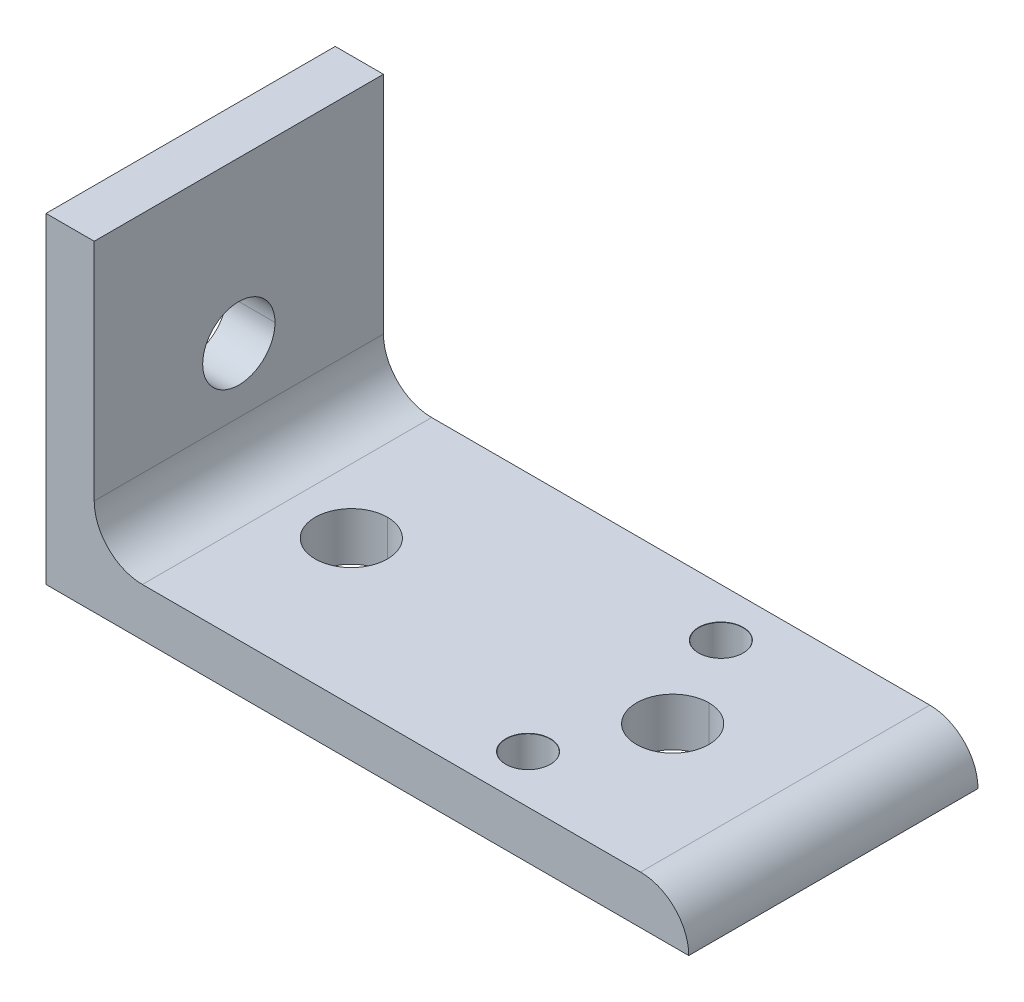
ISO-10303-21;
HEADER;
FILE_DESCRIPTION(('STEP AP214'),'2;1');
FILE_NAME('part.step','',(''),(''),'','','');
FILE_SCHEMA(('AUTOMOTIVE_DESIGN { 1 0 10303 214 1 1 1 1 }'));
ENDSEC;
DATA;
#1=APPLICATION_CONTEXT('core data for automotive mechanical design processes');
#2=APPLICATION_PROTOCOL_DEFINITION('international standard','automotive_design',2000,#1);
#3=PRODUCT_CONTEXT('',#1,'mechanical');
#4=PRODUCT('Part','Part','',(#3));
#5=PRODUCT_RELATED_PRODUCT_CATEGORY('part','',(#4));
#6=PRODUCT_DEFINITION_FORMATION('','',#4);
#7=PRODUCT_DEFINITION_CONTEXT('part definition',#1,'design');
#8=PRODUCT_DEFINITION('design','',#6,#7);
#9=PRODUCT_DEFINITION_SHAPE('','',#8);
#10=(LENGTH_UNIT() NAMED_UNIT(*) SI_UNIT(.MILLI.,.METRE.));
#11=(NAMED_UNIT(*) PLANE_ANGLE_UNIT() SI_UNIT($,.RADIAN.));
#12=(NAMED_UNIT(*) SI_UNIT($,.STERADIAN.) SOLID_ANGLE_UNIT());
#13=UNCERTAINTY_MEASURE_WITH_UNIT(LENGTH_MEASURE(1.E-05),#10,'distance_accuracy_value','');
#14=(GEOMETRIC_REPRESENTATION_CONTEXT(3) GLOBAL_UNCERTAINTY_ASSIGNED_CONTEXT((#13)) GLOBAL_UNIT_ASSIGNED_CONTEXT((#10,
#11,#12)) REPRESENTATION_CONTEXT('',''));
#15=CARTESIAN_POINT('',(0.,0.,0.));
#16=DIRECTION('',(0.,0.,1.));
#17=DIRECTION('',(1.,0.,0.));
#18=AXIS2_PLACEMENT_3D('',#15,#16,#17);
#19=CARTESIAN_POINT('',(80.,20.,0.));
#20=DIRECTION('',(-1.,0.,0.));
#21=DIRECTION('',(0.,0.,1.));
#22=AXIS2_PLACEMENT_3D('',#19,#20,#21);
#23=CYLINDRICAL_SURFACE('',#22,4.5);
#24=DIRECTION('',(-1.,0.,0.));
#25=VECTOR('',#24,1.);
#26=CARTESIAN_POINT('',(80.,20.,-4.5));
#27=LINE('',#26,#25);
#28=CARTESIAN_POINT('',(6.,20.,-4.5));
#29=VERTEX_POINT('',#28);
#30=CARTESIAN_POINT('',(0.,20.,-4.5));
#31=VERTEX_POINT('',#30);
#32=EDGE_CURVE('E290',#29,#31,#27,.T.);
#33=ORIENTED_EDGE('',*,*,#32,.F.);
#34=CARTESIAN_POINT('',(6.,20.,0.));
#35=DIRECTION('',(1.,0.,0.));
#36=DIRECTION('',(0.,-1.,0.));
#37=AXIS2_PLACEMENT_3D('',#34,#35,#36);
#38=CIRCLE('',#37,4.5);
#39=CARTESIAN_POINT('',(6.,20.,4.5));
#40=VERTEX_POINT('',#39);
#41=EDGE_CURVE('E209',#29,#40,#38,.T.);
#42=ORIENTED_EDGE('',*,*,#41,.T.);
#43=DIRECTION('',(-1.,0.,0.));
#44=VECTOR('',#43,1.);
#45=CARTESIAN_POINT('',(80.,20.,4.5));
#46=LINE('',#45,#44);
#47=CARTESIAN_POINT('',(0.,20.,4.5));
#48=VERTEX_POINT('',#47);
#49=EDGE_CURVE('E304',#40,#48,#46,.T.);
#50=ORIENTED_EDGE('',*,*,#49,.T.);
#51=CARTESIAN_POINT('',(0.,20.,0.));
#52=DIRECTION('',(1.,0.,0.));
#53=DIRECTION('',(0.,0.,-1.));
#54=AXIS2_PLACEMENT_3D('',#51,#52,#53);
#55=CIRCLE('',#54,4.5);
#56=EDGE_CURVE('E215',#31,#48,#55,.T.);
#57=ORIENTED_EDGE('',*,*,#56,.F.);
#58=EDGE_LOOP('',(#33,#42,#50,#57));
#59=FACE_BOUND('',#58,.T.);
#60=ADVANCED_FACE('F53',(#59),#23,.F.);
#61=CARTESIAN_POINT('',(60.,80.,0.));
#62=DIRECTION('',(0.,-1.,0.));
#63=DIRECTION('',(0.,0.,-1.));
#64=AXIS2_PLACEMENT_3D('',#61,#62,#63);
#65=CYLINDRICAL_SURFACE('',#64,4.5);
#66=DIRECTION('',(0.,-1.,0.));
#67=VECTOR('',#66,1.);
#68=CARTESIAN_POINT('',(60.,80.,4.5));
#69=LINE('',#68,#67);
#70=CARTESIAN_POINT('',(60.,6.,4.5));
#71=VERTEX_POINT('',#70);
#72=CARTESIAN_POINT('',(60.,0.,4.5));
#73=VERTEX_POINT('',#72);
#74=EDGE_CURVE('E295',#71,#73,#69,.T.);
#75=ORIENTED_EDGE('',*,*,#74,.F.);
#76=CARTESIAN_POINT('',(60.,6.,0.));
#77=DIRECTION('',(0.,1.,0.));
#78=DIRECTION('',(1.,0.,0.));
#79=AXIS2_PLACEMENT_3D('',#76,#77,#78);
#80=CIRCLE('',#79,4.5);
#81=CARTESIAN_POINT('',(60.,6.,-4.5));
#82=VERTEX_POINT('',#81);
#83=EDGE_CURVE('E250',#71,#82,#80,.T.);
#84=ORIENTED_EDGE('',*,*,#83,.T.);
#85=DIRECTION('',(0.,-1.,0.));
#86=VECTOR('',#85,1.);
#87=CARTESIAN_POINT('',(60.,80.,-4.5));
#88=LINE('',#87,#86);
#89=CARTESIAN_POINT('',(60.,0.,-4.5));
#90=VERTEX_POINT('',#89);
#91=EDGE_CURVE('E323',#82,#90,#88,.T.);
#92=ORIENTED_EDGE('',*,*,#91,.T.);
#93=CARTESIAN_POINT('',(60.,0.,0.));
#94=DIRECTION('',(0.,1.,0.));
#95=DIRECTION('',(0.,0.,1.));
#96=AXIS2_PLACEMENT_3D('',#93,#94,#95);
#97=CIRCLE('',#96,4.5);
#98=EDGE_CURVE('E230',#73,#90,#97,.T.);
#99=ORIENTED_EDGE('',*,*,#98,.F.);
#100=EDGE_LOOP('',(#75,#84,#92,#99));
#101=FACE_BOUND('',#100,.T.);
#102=ADVANCED_FACE('F369',(#101),#65,.F.);
#103=CARTESIAN_POINT('',(20.,80.,0.));
#104=DIRECTION('',(0.,-1.,0.));
#105=DIRECTION('',(0.,0.,-1.));
#106=AXIS2_PLACEMENT_3D('',#103,#104,#105);
#107=CYLINDRICAL_SURFACE('',#106,4.5);
#108=DIRECTION('',(0.,-1.,0.));
#109=VECTOR('',#108,1.);
#110=CARTESIAN_POINT('',(20.,80.,4.5));
#111=LINE('',#110,#109);
#112=CARTESIAN_POINT('',(20.,6.,4.5));
#113=VERTEX_POINT('',#112);
#114=CARTESIAN_POINT('',(20.,0.,4.5));
#115=VERTEX_POINT('',#114);
#116=EDGE_CURVE('E315',#113,#115,#111,.T.);
#117=ORIENTED_EDGE('',*,*,#116,.F.);
#118=CARTESIAN_POINT('',(20.,6.,0.));
#119=DIRECTION('',(0.,1.,0.));
#120=DIRECTION('',(1.,0.,0.));
#121=AXIS2_PLACEMENT_3D('',#118,#119,#120);
#122=CIRCLE('',#121,4.5);
#123=CARTESIAN_POINT('',(20.,6.,-4.5));
#124=VERTEX_POINT('',#123);
#125=EDGE_CURVE('E249',#113,#124,#122,.T.);
#126=ORIENTED_EDGE('',*,*,#125,.T.);
#127=DIRECTION('',(0.,-1.,0.));
#128=VECTOR('',#127,1.);
#129=CARTESIAN_POINT('',(20.,80.,-4.5));
#130=LINE('',#129,#128);
#131=CARTESIAN_POINT('',(20.,0.,-4.5));
#132=VERTEX_POINT('',#131);
#133=EDGE_CURVE('E196',#124,#132,#130,.T.);
#134=ORIENTED_EDGE('',*,*,#133,.T.);
#135=CARTESIAN_POINT('',(20.,0.,0.));
#136=DIRECTION('',(0.,1.,0.));
#137=DIRECTION('',(0.,0.,1.));
#138=AXIS2_PLACEMENT_3D('',#135,#136,#137);
#139=CIRCLE('',#138,4.5);
#140=EDGE_CURVE('E234',#115,#132,#139,.T.);
#141=ORIENTED_EDGE('',*,*,#140,.F.);
#142=EDGE_LOOP('',(#117,#126,#134,#141));
#143=FACE_BOUND('',#142,.T.);
#144=ADVANCED_FACE('F344',(#143),#107,.F.);
#145=CARTESIAN_POINT('',(0.,74.,-18.));
#146=DIRECTION('',(0.,0.,1.));
#147=DIRECTION('',(1.,0.,0.));
#148=AXIS2_PLACEMENT_3D('',#145,#146,#147);
#149=PLANE('',#148);
#150=DIRECTION('',(0.,-1.,0.));
#151=VECTOR('',#150,1.);
#152=CARTESIAN_POINT('',(0.,0.,-18.));
#153=LINE('',#152,#151);
#154=CARTESIAN_POINT('',(0.,40.,-18.));
#155=VERTEX_POINT('',#154);
#156=CARTESIAN_POINT('',(0.,0.,-18.));
#157=VERTEX_POINT('',#156);
#158=EDGE_CURVE('E186',#155,#157,#153,.T.);
#159=ORIENTED_EDGE('',*,*,#158,.F.);
#160=DIRECTION('',(-1.,0.,0.));
#161=VECTOR('',#160,1.);
#162=CARTESIAN_POINT('',(26.3729055621326,40.,-18.));
#163=LINE('',#162,#161);
#164=CARTESIAN_POINT('',(6.,40.,-18.));
#165=VERTEX_POINT('',#164);
#166=EDGE_CURVE('E175',#165,#155,#163,.T.);
#167=ORIENTED_EDGE('',*,*,#166,.F.);
#168=DIRECTION('',(0.,1.,0.));
#169=VECTOR('',#168,1.);
#170=CARTESIAN_POINT('',(6.,74.,-18.));
#171=LINE('',#170,#169);
#172=CARTESIAN_POINT('',(6.,12.,-18.));
#173=VERTEX_POINT('',#172);
#174=EDGE_CURVE('E184',#173,#165,#171,.T.);
#175=ORIENTED_EDGE('',*,*,#174,.F.);
#176=CARTESIAN_POINT('',(12.,12.,-18.));
#177=DIRECTION('',(0.,0.,-1.));
#178=DIRECTION('',(1.,0.,0.));
#179=AXIS2_PLACEMENT_3D('',#176,#177,#178);
#180=CIRCLE('',#179,6.);
#181=CARTESIAN_POINT('',(12.,6.,-18.));
#182=VERTEX_POINT('',#181);
#183=EDGE_CURVE('E256',#182,#173,#180,.T.);
#184=ORIENTED_EDGE('',*,*,#183,.F.);
#185=DIRECTION('',(-1.,0.,0.));
#186=VECTOR('',#185,1.);
#187=CARTESIAN_POINT('',(12.,6.,-18.));
#188=LINE('',#187,#186);
#189=CARTESIAN_POINT('',(74.,6.,-18.));
#190=VERTEX_POINT('',#189);
#191=EDGE_CURVE('E233',#190,#182,#188,.T.);
#192=ORIENTED_EDGE('',*,*,#191,.F.);
#193=CARTESIAN_POINT('',(74.,0.,-18.));
#194=DIRECTION('',(0.,0.,1.));
#195=DIRECTION('',(1.,0.,0.));
#196=AXIS2_PLACEMENT_3D('',#193,#194,#195);
#197=CIRCLE('',#196,6.);
#198=CARTESIAN_POINT('',(80.,0.,-18.));
#199=VERTEX_POINT('',#198);
#200=EDGE_CURVE('E253',#199,#190,#197,.T.);
#201=ORIENTED_EDGE('',*,*,#200,.F.);
#202=DIRECTION('',(1.,0.,0.));
#203=VECTOR('',#202,1.);
#204=CARTESIAN_POINT('',(80.,0.,-18.));
#205=LINE('',#204,#203);
#206=EDGE_CURVE('E221',#157,#199,#205,.T.);
#207=ORIENTED_EDGE('',*,*,#206,.F.);
#208=EDGE_LOOP('',(#159,#167,#175,#184,#192,#201,#207));
#209=FACE_BOUND('',#208,.T.);
#210=ADVANCED_FACE('F55',(#209),#149,.F.);
#211=CARTESIAN_POINT('',(0.,74.,18.));
#212=DIRECTION('',(0.,0.,1.));
#213=DIRECTION('',(1.,0.,0.));
#214=AXIS2_PLACEMENT_3D('',#211,#212,#213);
#215=PLANE('',#214);
#216=DIRECTION('',(-1.,0.,0.));
#217=VECTOR('',#216,1.);
#218=CARTESIAN_POINT('',(26.3729055621326,40.,18.));
#219=LINE('',#218,#217);
#220=CARTESIAN_POINT('',(6.,40.,18.));
#221=VERTEX_POINT('',#220);
#222=CARTESIAN_POINT('',(0.,40.,18.));
#223=VERTEX_POINT('',#222);
#224=EDGE_CURVE('E71',#221,#223,#219,.T.);
#225=ORIENTED_EDGE('',*,*,#224,.T.);
#226=DIRECTION('',(0.,-1.,0.));
#227=VECTOR('',#226,1.);
#228=CARTESIAN_POINT('',(0.,0.,18.));
#229=LINE('',#228,#227);
#230=CARTESIAN_POINT('',(0.,0.,18.));
#231=VERTEX_POINT('',#230);
#232=EDGE_CURVE('E212',#223,#231,#229,.T.);
#233=ORIENTED_EDGE('',*,*,#232,.T.);
#234=DIRECTION('',(1.,0.,0.));
#235=VECTOR('',#234,1.);
#236=CARTESIAN_POINT('',(80.,0.,18.));
#237=LINE('',#236,#235);
#238=CARTESIAN_POINT('',(80.,0.,18.));
#239=VERTEX_POINT('',#238);
#240=EDGE_CURVE('E229',#231,#239,#237,.T.);
#241=ORIENTED_EDGE('',*,*,#240,.T.);
#242=CARTESIAN_POINT('',(74.,0.,18.));
#243=DIRECTION('',(0.,0.,1.));
#244=DIRECTION('',(1.,0.,0.));
#245=AXIS2_PLACEMENT_3D('',#242,#243,#244);
#246=CIRCLE('',#245,6.);
#247=CARTESIAN_POINT('',(74.,6.,18.));
#248=VERTEX_POINT('',#247);
#249=EDGE_CURVE('E83',#239,#248,#246,.T.);
#250=ORIENTED_EDGE('',*,*,#249,.T.);
#251=DIRECTION('',(-1.,0.,0.));
#252=VECTOR('',#251,1.);
#253=CARTESIAN_POINT('',(12.,6.,18.));
#254=LINE('',#253,#252);
#255=CARTESIAN_POINT('',(12.,6.,18.));
#256=VERTEX_POINT('',#255);
#257=EDGE_CURVE('E242',#248,#256,#254,.T.);
#258=ORIENTED_EDGE('',*,*,#257,.T.);
#259=CARTESIAN_POINT('',(12.,12.,18.));
#260=DIRECTION('',(0.,0.,-1.));
#261=DIRECTION('',(1.,0.,0.));
#262=AXIS2_PLACEMENT_3D('',#259,#260,#261);
#263=CIRCLE('',#262,6.);
#264=CARTESIAN_POINT('',(6.,12.,18.));
#265=VERTEX_POINT('',#264);
#266=EDGE_CURVE('E63',#256,#265,#263,.T.);
#267=ORIENTED_EDGE('',*,*,#266,.T.);
#268=DIRECTION('',(0.,1.,0.));
#269=VECTOR('',#268,1.);
#270=CARTESIAN_POINT('',(6.,74.,18.));
#271=LINE('',#270,#269);
#272=EDGE_CURVE('E195',#265,#221,#271,.T.);
#273=ORIENTED_EDGE('',*,*,#272,.T.);
#274=EDGE_LOOP('',(#225,#233,#241,#250,#258,#267,#273));
#275=FACE_BOUND('',#274,.T.);
#276=ADVANCED_FACE('F357',(#275),#215,.T.);
#277=CARTESIAN_POINT('',(12.,12.,18.));
#278=DIRECTION('',(0.,0.,-1.));
#279=DIRECTION('',(-1.,0.,0.));
#280=AXIS2_PLACEMENT_3D('',#277,#278,#279);
#281=CYLINDRICAL_SURFACE('',#280,6.);
#282=ORIENTED_EDGE('',*,*,#183,.T.);
#283=DIRECTION('',(0.,0.,-1.));
#284=VECTOR('',#283,1.);
#285=CARTESIAN_POINT('',(6.,12.,18.));
#286=LINE('',#285,#284);
#287=EDGE_CURVE('E193',#265,#173,#286,.T.);
#288=ORIENTED_EDGE('',*,*,#287,.F.);
#289=ORIENTED_EDGE('',*,*,#266,.F.);
#290=DIRECTION('',(0.,0.,-1.));
#291=VECTOR('',#290,1.);
#292=CARTESIAN_POINT('',(12.,6.,18.));
#293=LINE('',#292,#291);
#294=EDGE_CURVE('E238',#256,#182,#293,.T.);
#295=ORIENTED_EDGE('',*,*,#294,.T.);
#296=EDGE_LOOP('',(#282,#288,#289,#295));
#297=FACE_BOUND('',#296,.T.);
#298=ADVANCED_FACE('F356',(#297),#281,.F.);
#299=CARTESIAN_POINT('',(74.,0.,18.));
#300=DIRECTION('',(0.,0.,-1.));
#301=DIRECTION('',(-1.,0.,0.));
#302=AXIS2_PLACEMENT_3D('',#299,#300,#301);
#303=CYLINDRICAL_SURFACE('',#302,6.);
#304=ORIENTED_EDGE('',*,*,#200,.T.);
#305=DIRECTION('',(0.,0.,-1.));
#306=VECTOR('',#305,1.);
#307=CARTESIAN_POINT('',(74.,6.,18.));
#308=LINE('',#307,#306);
#309=EDGE_CURVE('E245',#248,#190,#308,.T.);
#310=ORIENTED_EDGE('',*,*,#309,.F.);
#311=ORIENTED_EDGE('',*,*,#249,.F.);
#312=DIRECTION('',(0.,0.,-1.));
#313=VECTOR('',#312,1.);
#314=CARTESIAN_POINT('',(80.,0.,18.));
#315=LINE('',#314,#313);
#316=EDGE_CURVE('E225',#239,#199,#315,.T.);
#317=ORIENTED_EDGE('',*,*,#316,.T.);
#318=EDGE_LOOP('',(#304,#310,#311,#317));
#319=FACE_BOUND('',#318,.T.);
#320=ADVANCED_FACE('F349',(#319),#303,.T.);
#321=CARTESIAN_POINT('',(12.,6.,18.));
#322=DIRECTION('',(0.,-1.,0.));
#323=DIRECTION('',(-1.,0.,0.));
#324=AXIS2_PLACEMENT_3D('',#321,#322,#323);
#325=PLANE('',#324);
#326=CARTESIAN_POINT('',(54.,6.,12.));
#327=DIRECTION('',(0.,1.,0.));
#328=DIRECTION('',(0.,0.,1.));
#329=AXIS2_PLACEMENT_3D('',#326,#327,#328);
#330=CIRCLE('',#329,2.775);
#331=CARTESIAN_POINT('',(54.,6.,14.775));
#332=VERTEX_POINT('',#331);
#333=EDGE_CURVE('E438',#332,#332,#330,.T.);
#334=ORIENTED_EDGE('',*,*,#333,.F.);
#335=EDGE_LOOP('',(#334));
#336=FACE_BOUND('',#335,.T.);
#337=CARTESIAN_POINT('',(54.,6.,-12.));
#338=DIRECTION('',(0.,1.,0.));
#339=DIRECTION('',(0.,0.,1.));
#340=AXIS2_PLACEMENT_3D('',#337,#338,#339);
#341=CIRCLE('',#340,2.775);
#342=CARTESIAN_POINT('',(54.,6.,-9.225));
#343=VERTEX_POINT('',#342);
#344=EDGE_CURVE('E267',#343,#343,#341,.T.);
#345=ORIENTED_EDGE('',*,*,#344,.F.);
#346=EDGE_LOOP('',(#345));
#347=FACE_BOUND('',#346,.T.);
#348=CARTESIAN_POINT('',(60.,6.,0.));
#349=DIRECTION('',(0.,1.,0.));
#350=DIRECTION('',(1.,0.,0.));
#351=AXIS2_PLACEMENT_3D('',#348,#349,#350);
#352=CIRCLE('',#351,4.5);
#353=EDGE_CURVE('E300',#82,#71,#352,.T.);
#354=ORIENTED_EDGE('',*,*,#353,.F.);
#355=ORIENTED_EDGE('',*,*,#83,.F.);
#356=EDGE_LOOP('',(#354,#355));
#357=FACE_BOUND('',#356,.T.);
#358=CARTESIAN_POINT('',(20.,6.,0.));
#359=DIRECTION('',(0.,1.,0.));
#360=DIRECTION('',(1.,0.,0.));
#361=AXIS2_PLACEMENT_3D('',#358,#359,#360);
#362=CIRCLE('',#361,4.5);
#363=EDGE_CURVE('E319',#124,#113,#362,.T.);
#364=ORIENTED_EDGE('',*,*,#363,.F.);
#365=ORIENTED_EDGE('',*,*,#125,.F.);
#366=EDGE_LOOP('',(#364,#365));
#367=FACE_BOUND('',#366,.T.);
#368=ORIENTED_EDGE('',*,*,#191,.T.);
#369=ORIENTED_EDGE('',*,*,#294,.F.);
#370=ORIENTED_EDGE('',*,*,#257,.F.);
#371=ORIENTED_EDGE('',*,*,#309,.T.);
#372=EDGE_LOOP('',(#368,#369,#370,#371));
#373=FACE_BOUND('',#372,.T.);
#374=ADVANCED_FACE('F346',(#336,#347,#357,#367,#373),#325,.F.);
#375=CARTESIAN_POINT('',(80.,0.,18.));
#376=DIRECTION('',(0.,1.,0.));
#377=DIRECTION('',(1.,0.,0.));
#378=AXIS2_PLACEMENT_3D('',#375,#376,#377);
#379=PLANE('',#378);
#380=CARTESIAN_POINT('',(54.,0.,12.));
#381=DIRECTION('',(0.,1.,0.));
#382=DIRECTION('',(-1.,0.,0.));
#383=AXIS2_PLACEMENT_3D('',#380,#381,#382);
#384=CIRCLE('',#383,2.74999999999999);
#385=CARTESIAN_POINT('',(51.25,0.,12.));
#386=VERTEX_POINT('',#385);
#387=EDGE_CURVE('E57',#386,#386,#384,.T.);
#388=ORIENTED_EDGE('',*,*,#387,.T.);
#389=EDGE_LOOP('',(#388));
#390=FACE_BOUND('',#389,.T.);
#391=CARTESIAN_POINT('',(54.,0.,-12.));
#392=DIRECTION('',(0.,1.,0.));
#393=DIRECTION('',(-1.,0.,0.));
#394=AXIS2_PLACEMENT_3D('',#391,#392,#393);
#395=CIRCLE('',#394,2.74999999999999);
#396=CARTESIAN_POINT('',(51.25,0.,-12.));
#397=VERTEX_POINT('',#396);
#398=EDGE_CURVE('E188',#397,#397,#395,.T.);
#399=ORIENTED_EDGE('',*,*,#398,.T.);
#400=EDGE_LOOP('',(#399));
#401=FACE_BOUND('',#400,.T.);
#402=CARTESIAN_POINT('',(60.,0.,0.));
#403=DIRECTION('',(0.,1.,0.));
#404=DIRECTION('',(0.,0.,1.));
#405=AXIS2_PLACEMENT_3D('',#402,#403,#404);
#406=CIRCLE('',#405,4.5);
#407=EDGE_CURVE('E299',#90,#73,#406,.T.);
#408=ORIENTED_EDGE('',*,*,#407,.T.);
#409=ORIENTED_EDGE('',*,*,#98,.T.);
#410=EDGE_LOOP('',(#408,#409));
#411=FACE_BOUND('',#410,.T.);
#412=CARTESIAN_POINT('',(20.,0.,0.));
#413=DIRECTION('',(0.,1.,0.));
#414=DIRECTION('',(0.,0.,1.));
#415=AXIS2_PLACEMENT_3D('',#412,#413,#414);
#416=CIRCLE('',#415,4.5);
#417=EDGE_CURVE('E203',#132,#115,#416,.T.);
#418=ORIENTED_EDGE('',*,*,#417,.T.);
#419=ORIENTED_EDGE('',*,*,#140,.T.);
#420=EDGE_LOOP('',(#418,#419));
#421=FACE_BOUND('',#420,.T.);
#422=ORIENTED_EDGE('',*,*,#206,.T.);
#423=ORIENTED_EDGE('',*,*,#316,.F.);
#424=ORIENTED_EDGE('',*,*,#240,.F.);
#425=DIRECTION('',(0.,0.,-1.));
#426=VECTOR('',#425,1.);
#427=CARTESIAN_POINT('',(0.,0.,18.));
#428=LINE('',#427,#426);
#429=EDGE_CURVE('E216',#231,#157,#428,.T.);
#430=ORIENTED_EDGE('',*,*,#429,.T.);
#431=EDGE_LOOP('',(#422,#423,#424,#430));
#432=FACE_BOUND('',#431,.T.);
#433=ADVANCED_FACE('F336',(#390,#401,#411,#421,#432),#379,.F.);
#434=CARTESIAN_POINT('',(0.,0.,18.));
#435=DIRECTION('',(1.,0.,0.));
#436=DIRECTION('',(0.,1.,0.));
#437=AXIS2_PLACEMENT_3D('',#434,#435,#436);
#438=PLANE('',#437);
#439=CARTESIAN_POINT('',(0.,20.,0.));
#440=DIRECTION('',(1.,0.,0.));
#441=DIRECTION('',(0.,0.,-1.));
#442=AXIS2_PLACEMENT_3D('',#439,#440,#441);
#443=CIRCLE('',#442,4.5);
#444=EDGE_CURVE('E294',#48,#31,#443,.T.);
#445=ORIENTED_EDGE('',*,*,#444,.T.);
#446=ORIENTED_EDGE('',*,*,#56,.T.);
#447=EDGE_LOOP('',(#445,#446));
#448=FACE_BOUND('',#447,.T.);
#449=ORIENTED_EDGE('',*,*,#232,.F.);
#450=DIRECTION('',(0.,0.,-1.));
#451=VECTOR('',#450,1.);
#452=CARTESIAN_POINT('',(0.,40.,18.));
#453=LINE('',#452,#451);
#454=EDGE_CURVE('E277',#223,#155,#453,.T.);
#455=ORIENTED_EDGE('',*,*,#454,.T.);
#456=ORIENTED_EDGE('',*,*,#158,.T.);
#457=ORIENTED_EDGE('',*,*,#429,.F.);
#458=EDGE_LOOP('',(#449,#455,#456,#457));
#459=FACE_BOUND('',#458,.T.);
#460=ADVANCED_FACE('F383',(#448,#459),#438,.F.);
#461=CARTESIAN_POINT('',(6.,74.,18.));
#462=DIRECTION('',(-1.,0.,0.));
#463=DIRECTION('',(0.,1.,0.));
#464=AXIS2_PLACEMENT_3D('',#461,#462,#463);
#465=PLANE('',#464);
#466=CARTESIAN_POINT('',(6.,20.,0.));
#467=DIRECTION('',(1.,0.,0.));
#468=DIRECTION('',(0.,-1.,0.));
#469=AXIS2_PLACEMENT_3D('',#466,#467,#468);
#470=CIRCLE('',#469,4.5);
#471=EDGE_CURVE('E281',#40,#29,#470,.T.);
#472=ORIENTED_EDGE('',*,*,#471,.F.);
#473=ORIENTED_EDGE('',*,*,#41,.F.);
#474=EDGE_LOOP('',(#472,#473));
#475=FACE_BOUND('',#474,.T.);
#476=ORIENTED_EDGE('',*,*,#174,.T.);
#477=DIRECTION('',(0.,0.,1.));
#478=VECTOR('',#477,1.);
#479=CARTESIAN_POINT('',(6.,40.,18.));
#480=LINE('',#479,#478);
#481=EDGE_CURVE('E11',#165,#221,#480,.T.);
#482=ORIENTED_EDGE('',*,*,#481,.T.);
#483=ORIENTED_EDGE('',*,*,#272,.F.);
#484=ORIENTED_EDGE('',*,*,#287,.T.);
#485=EDGE_LOOP('',(#476,#482,#483,#484));
#486=FACE_BOUND('',#485,.T.);
#487=ADVANCED_FACE('F191',(#475,#486),#465,.F.);
#488=CARTESIAN_POINT('',(20.,80.,0.));
#489=DIRECTION('',(0.,-1.,0.));
#490=DIRECTION('',(0.,0.,-1.));
#491=AXIS2_PLACEMENT_3D('',#488,#489,#490);
#492=CYLINDRICAL_SURFACE('',#491,4.5);
#493=ORIENTED_EDGE('',*,*,#363,.T.);
#494=ORIENTED_EDGE('',*,*,#116,.T.);
#495=ORIENTED_EDGE('',*,*,#417,.F.);
#496=ORIENTED_EDGE('',*,*,#133,.F.);
#497=EDGE_LOOP('',(#493,#494,#495,#496));
#498=FACE_BOUND('',#497,.T.);
#499=ADVANCED_FACE('F341',(#498),#492,.F.);
#500=CARTESIAN_POINT('',(60.,80.,0.));
#501=DIRECTION('',(0.,-1.,0.));
#502=DIRECTION('',(0.,0.,-1.));
#503=AXIS2_PLACEMENT_3D('',#500,#501,#502);
#504=CYLINDRICAL_SURFACE('',#503,4.5);
#505=ORIENTED_EDGE('',*,*,#353,.T.);
#506=ORIENTED_EDGE('',*,*,#74,.T.);
#507=ORIENTED_EDGE('',*,*,#407,.F.);
#508=ORIENTED_EDGE('',*,*,#91,.F.);
#509=EDGE_LOOP('',(#505,#506,#507,#508));
#510=FACE_BOUND('',#509,.T.);
#511=ADVANCED_FACE('F386',(#510),#504,.F.);
#512=CARTESIAN_POINT('',(80.,20.,0.));
#513=DIRECTION('',(-1.,0.,0.));
#514=DIRECTION('',(0.,0.,1.));
#515=AXIS2_PLACEMENT_3D('',#512,#513,#514);
#516=CYLINDRICAL_SURFACE('',#515,4.5);
#517=ORIENTED_EDGE('',*,*,#471,.T.);
#518=ORIENTED_EDGE('',*,*,#32,.T.);
#519=ORIENTED_EDGE('',*,*,#444,.F.);
#520=ORIENTED_EDGE('',*,*,#49,.F.);
#521=EDGE_LOOP('',(#517,#518,#519,#520));
#522=FACE_BOUND('',#521,.T.);
#523=ADVANCED_FACE('F406',(#522),#516,.F.);
#524=CARTESIAN_POINT('',(26.3729055621326,40.,18.));
#525=DIRECTION('',(0.,-1.,0.));
#526=DIRECTION('',(0.,0.,-1.));
#527=AXIS2_PLACEMENT_3D('',#524,#525,#526);
#528=PLANE('',#527);
#529=ORIENTED_EDGE('',*,*,#224,.F.);
#530=ORIENTED_EDGE('',*,*,#481,.F.);
#531=ORIENTED_EDGE('',*,*,#166,.T.);
#532=ORIENTED_EDGE('',*,*,#454,.F.);
#533=EDGE_LOOP('',(#529,#530,#531,#532));
#534=FACE_BOUND('',#533,.T.);
#535=ADVANCED_FACE('F174',(#534),#528,.F.);
#536=CARTESIAN_POINT('',(54.,6.,-12.));
#537=DIRECTION('',(0.,1.,0.));
#538=DIRECTION('',(0.,0.,1.));
#539=AXIS2_PLACEMENT_3D('',#536,#537,#538);
#540=CYLINDRICAL_SURFACE('',#539,2.74999999999999);
#541=CARTESIAN_POINT('',(54.,5.97499999999999,-12.));
#542=DIRECTION('',(0.,1.,0.));
#543=DIRECTION('',(0.,0.,1.));
#544=AXIS2_PLACEMENT_3D('',#541,#542,#543);
#545=CIRCLE('',#544,2.74999999999999);
#546=CARTESIAN_POINT('',(54.,5.97499999999999,-9.25000000000001));
#547=VERTEX_POINT('',#546);
#548=EDGE_CURVE('E262',#547,#547,#545,.T.);
#549=ORIENTED_EDGE('',*,*,#548,.T.);
#550=EDGE_LOOP('',(#549));
#551=FACE_BOUND('',#550,.T.);
#552=ORIENTED_EDGE('',*,*,#398,.F.);
#553=EDGE_LOOP('',(#552));
#554=FACE_BOUND('',#553,.T.);
#555=ADVANCED_FACE('F417',(#551,#554),#540,.F.);
#556=CARTESIAN_POINT('',(54.,6.,-12.));
#557=DIRECTION('',(0.,1.,0.));
#558=DIRECTION('',(0.,0.,1.));
#559=AXIS2_PLACEMENT_3D('',#556,#557,#558);
#560=CONICAL_SURFACE('',#559,2.775,0.785398163397414);
#561=ORIENTED_EDGE('',*,*,#548,.F.);
#562=EDGE_LOOP('',(#561));
#563=FACE_BOUND('',#562,.T.);
#564=ORIENTED_EDGE('',*,*,#344,.T.);
#565=EDGE_LOOP('',(#564));
#566=FACE_BOUND('',#565,.T.);
#567=ADVANCED_FACE('F419',(#563,#566),#560,.F.);
#568=CARTESIAN_POINT('',(54.,6.,12.));
#569=DIRECTION('',(0.,1.,0.));
#570=DIRECTION('',(0.,0.,1.));
#571=AXIS2_PLACEMENT_3D('',#568,#569,#570);
#572=CYLINDRICAL_SURFACE('',#571,2.74999999999999);
#573=CARTESIAN_POINT('',(54.,5.97499999999999,12.));
#574=DIRECTION('',(0.,1.,0.));
#575=DIRECTION('',(0.,0.,1.));
#576=AXIS2_PLACEMENT_3D('',#573,#574,#575);
#577=CIRCLE('',#576,2.74999999999999);
#578=CARTESIAN_POINT('',(54.,5.97499999999999,14.75));
#579=VERTEX_POINT('',#578);
#580=EDGE_CURVE('E435',#579,#579,#577,.T.);
#581=ORIENTED_EDGE('',*,*,#580,.T.);
#582=EDGE_LOOP('',(#581));
#583=FACE_BOUND('',#582,.T.);
#584=ORIENTED_EDGE('',*,*,#387,.F.);
#585=EDGE_LOOP('',(#584));
#586=FACE_BOUND('',#585,.T.);
#587=ADVANCED_FACE('F422',(#583,#586),#572,.F.);
#588=CARTESIAN_POINT('',(54.,6.,12.));
#589=DIRECTION('',(0.,1.,0.));
#590=DIRECTION('',(0.,0.,1.));
#591=AXIS2_PLACEMENT_3D('',#588,#589,#590);
#592=CONICAL_SURFACE('',#591,2.775,0.785398163397414);
#593=ORIENTED_EDGE('',*,*,#580,.F.);
#594=EDGE_LOOP('',(#593));
#595=FACE_BOUND('',#594,.T.);
#596=ORIENTED_EDGE('',*,*,#333,.T.);
#597=EDGE_LOOP('',(#596));
#598=FACE_BOUND('',#597,.T.);
#599=ADVANCED_FACE('F426',(#595,#598),#592,.F.);
#600=CLOSED_SHELL('',(#60,#102,#144,#210,#276,#298,#320,#374,#433,#460,#487,#499,#511,#523,#535,
#555,#567,#587,#599));
#601=MANIFOLD_SOLID_BREP('B2',#600);
#602=ADVANCED_BREP_SHAPE_REPRESENTATION('',(#18,#601),#14);
#603=SHAPE_DEFINITION_REPRESENTATION(#9,#602);
ENDSEC;
END-ISO-10303-21;
